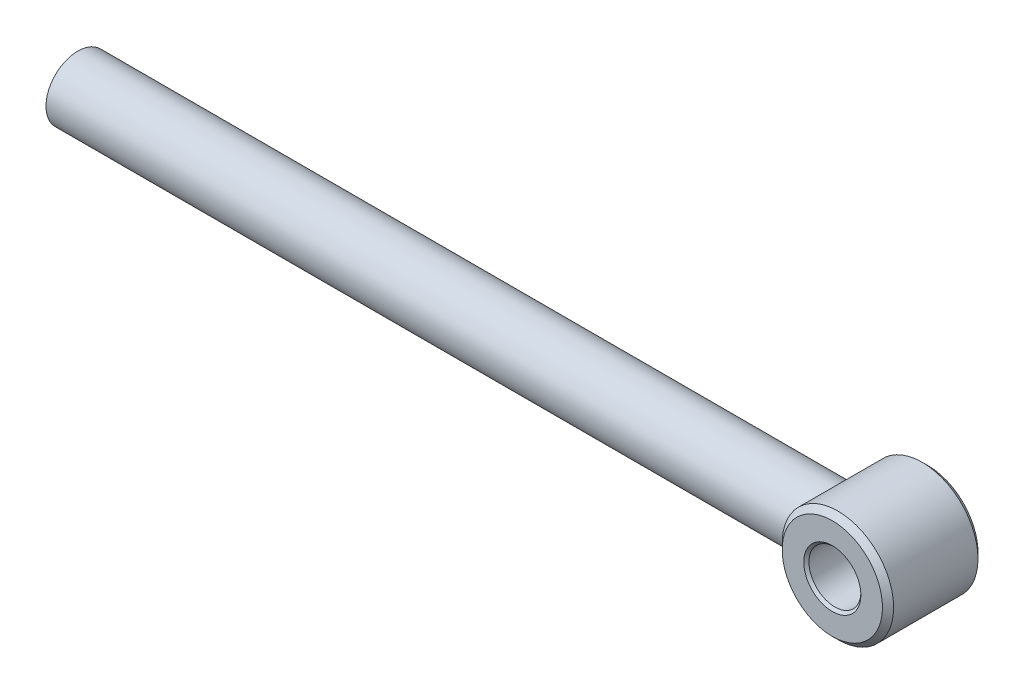
ISO-10303-21;
HEADER;
FILE_DESCRIPTION(('STEP AP214'),'2;1');
FILE_NAME('part.step','',(''),(''),'','','');
FILE_SCHEMA(('AUTOMOTIVE_DESIGN { 1 0 10303 214 1 1 1 1 }'));
ENDSEC;
DATA;
#1=APPLICATION_CONTEXT('core data for automotive mechanical design processes');
#2=APPLICATION_PROTOCOL_DEFINITION('international standard','automotive_design',2000,#1);
#3=PRODUCT_CONTEXT('',#1,'mechanical');
#4=PRODUCT('Part','Part','',(#3));
#5=PRODUCT_RELATED_PRODUCT_CATEGORY('part','',(#4));
#6=PRODUCT_DEFINITION_FORMATION('','',#4);
#7=PRODUCT_DEFINITION_CONTEXT('part definition',#1,'design');
#8=PRODUCT_DEFINITION('design','',#6,#7);
#9=PRODUCT_DEFINITION_SHAPE('','',#8);
#10=(LENGTH_UNIT() NAMED_UNIT(*) SI_UNIT(.MILLI.,.METRE.));
#11=(NAMED_UNIT(*) PLANE_ANGLE_UNIT() SI_UNIT($,.RADIAN.));
#12=(NAMED_UNIT(*) SI_UNIT($,.STERADIAN.) SOLID_ANGLE_UNIT());
#13=UNCERTAINTY_MEASURE_WITH_UNIT(LENGTH_MEASURE(1.E-05),#10,'distance_accuracy_value','');
#14=(GEOMETRIC_REPRESENTATION_CONTEXT(3) GLOBAL_UNCERTAINTY_ASSIGNED_CONTEXT((#13)) GLOBAL_UNIT_ASSIGNED_CONTEXT((#10,
#11,#12)) REPRESENTATION_CONTEXT('',''));
#15=CARTESIAN_POINT('',(0.,0.,0.));
#16=DIRECTION('',(0.,0.,1.));
#17=DIRECTION('',(1.,0.,0.));
#18=AXIS2_PLACEMENT_3D('',#15,#16,#17);
#19=CARTESIAN_POINT('',(340.,0.,-14.5925));
#20=DIRECTION('',(0.,0.,-1.));
#21=DIRECTION('',(1.,0.,0.));
#22=AXIS2_PLACEMENT_3D('',#19,#20,#21);
#23=CONICAL_SURFACE('',#22,8.5575,0.785398163397448);
#24=CARTESIAN_POINT('',(340.,0.,-14.185));
#25=DIRECTION('',(0.,0.,-1.));
#26=DIRECTION('',(1.,0.,0.));
#27=AXIS2_PLACEMENT_3D('',#24,#25,#26);
#28=CIRCLE('',#27,8.15);
#29=CARTESIAN_POINT('',(348.15,0.,-14.185));
#30=VERTEX_POINT('',#29);
#31=EDGE_CURVE('E11',#30,#30,#28,.T.);
#32=ORIENTED_EDGE('',*,*,#31,.F.);
#33=EDGE_LOOP('',(#32));
#34=FACE_BOUND('',#33,.T.);
#35=CARTESIAN_POINT('',(340.,0.,-15.));
#36=DIRECTION('',(0.,0.,1.));
#37=DIRECTION('',(1.,0.,0.));
#38=AXIS2_PLACEMENT_3D('',#35,#36,#37);
#39=CIRCLE('',#38,8.965);
#40=CARTESIAN_POINT('',(348.965,0.,-15.));
#41=VERTEX_POINT('',#40);
#42=EDGE_CURVE('E68',#41,#41,#39,.T.);
#43=ORIENTED_EDGE('',*,*,#42,.F.);
#44=EDGE_LOOP('',(#43));
#45=FACE_BOUND('',#44,.T.);
#46=ADVANCED_FACE('F16',(#34,#45),#23,.F.);
#47=CARTESIAN_POINT('',(340.,0.,14.5925));
#48=DIRECTION('',(0.,0.,1.));
#49=DIRECTION('',(-1.,0.,0.));
#50=AXIS2_PLACEMENT_3D('',#47,#48,#49);
#51=CONICAL_SURFACE('',#50,8.5575,0.785398163397448);
#52=CARTESIAN_POINT('',(340.,0.,14.185));
#53=DIRECTION('',(0.,0.,1.));
#54=DIRECTION('',(1.,0.,0.));
#55=AXIS2_PLACEMENT_3D('',#52,#53,#54);
#56=CIRCLE('',#55,8.15);
#57=CARTESIAN_POINT('',(331.85,0.,14.185));
#58=VERTEX_POINT('',#57);
#59=EDGE_CURVE('E28',#58,#58,#56,.T.);
#60=ORIENTED_EDGE('',*,*,#59,.F.);
#61=EDGE_LOOP('',(#60));
#62=FACE_BOUND('',#61,.T.);
#63=CARTESIAN_POINT('',(340.,0.,15.));
#64=DIRECTION('',(0.,0.,-1.));
#65=DIRECTION('',(-1.,0.,0.));
#66=AXIS2_PLACEMENT_3D('',#63,#64,#65);
#67=CIRCLE('',#66,8.965);
#68=CARTESIAN_POINT('',(331.035,0.,15.));
#69=VERTEX_POINT('',#68);
#70=EDGE_CURVE('E72',#69,#69,#67,.T.);
#71=ORIENTED_EDGE('',*,*,#70,.F.);
#72=EDGE_LOOP('',(#71));
#73=FACE_BOUND('',#72,.T.);
#74=ADVANCED_FACE('F58',(#62,#73),#51,.F.);
#75=CARTESIAN_POINT('',(340.,0.,14.125));
#76=DIRECTION('',(0.,0.,-1.));
#77=DIRECTION('',(1.,0.,0.));
#78=AXIS2_PLACEMENT_3D('',#75,#76,#77);
#79=CONICAL_SURFACE('',#78,16.625,0.785398163397448);
#80=CARTESIAN_POINT('',(340.,0.,13.25));
#81=DIRECTION('',(0.,0.,-1.));
#82=DIRECTION('',(1.,0.,0.));
#83=AXIS2_PLACEMENT_3D('',#80,#81,#82);
#84=CIRCLE('',#83,17.5);
#85=CARTESIAN_POINT('',(357.5,0.,13.25));
#86=VERTEX_POINT('',#85);
#87=EDGE_CURVE('E61',#86,#86,#84,.T.);
#88=ORIENTED_EDGE('',*,*,#87,.F.);
#89=EDGE_LOOP('',(#88));
#90=FACE_BOUND('',#89,.T.);
#91=CARTESIAN_POINT('',(340.,0.,15.));
#92=DIRECTION('',(0.,0.,1.));
#93=DIRECTION('',(1.,0.,0.));
#94=AXIS2_PLACEMENT_3D('',#91,#92,#93);
#95=CIRCLE('',#94,15.75);
#96=CARTESIAN_POINT('',(355.75,0.,15.));
#97=VERTEX_POINT('',#96);
#98=EDGE_CURVE('E73',#97,#97,#95,.T.);
#99=ORIENTED_EDGE('',*,*,#98,.F.);
#100=EDGE_LOOP('',(#99));
#101=FACE_BOUND('',#100,.T.);
#102=ADVANCED_FACE('F103',(#90,#101),#79,.T.);
#103=CARTESIAN_POINT('',(340.,0.,-14.125));
#104=DIRECTION('',(0.,0.,1.));
#105=DIRECTION('',(-1.,0.,0.));
#106=AXIS2_PLACEMENT_3D('',#103,#104,#105);
#107=CONICAL_SURFACE('',#106,16.625,0.785398163397448);
#108=CARTESIAN_POINT('',(340.,0.,-13.25));
#109=DIRECTION('',(0.,0.,1.));
#110=DIRECTION('',(1.,0.,0.));
#111=AXIS2_PLACEMENT_3D('',#108,#109,#110);
#112=CIRCLE('',#111,17.5);
#113=CARTESIAN_POINT('',(322.5,0.,-13.25));
#114=VERTEX_POINT('',#113);
#115=EDGE_CURVE('E64',#114,#114,#112,.T.);
#116=ORIENTED_EDGE('',*,*,#115,.F.);
#117=EDGE_LOOP('',(#116));
#118=FACE_BOUND('',#117,.T.);
#119=CARTESIAN_POINT('',(340.,0.,-15.));
#120=DIRECTION('',(0.,0.,-1.));
#121=DIRECTION('',(-1.,0.,0.));
#122=AXIS2_PLACEMENT_3D('',#119,#120,#121);
#123=CIRCLE('',#122,15.75);
#124=CARTESIAN_POINT('',(324.25,0.,-15.));
#125=VERTEX_POINT('',#124);
#126=EDGE_CURVE('E132',#125,#125,#123,.T.);
#127=ORIENTED_EDGE('',*,*,#126,.F.);
#128=EDGE_LOOP('',(#127));
#129=FACE_BOUND('',#128,.T.);
#130=ADVANCED_FACE('F18',(#118,#129),#107,.T.);
#131=CARTESIAN_POINT('',(340.,0.,0.));
#132=DIRECTION('',(0.,0.,1.));
#133=DIRECTION('',(1.,0.,0.));
#134=AXIS2_PLACEMENT_3D('',#131,#132,#133);
#135=CYLINDRICAL_SURFACE('',#134,8.15);
#136=ORIENTED_EDGE('',*,*,#31,.T.);
#137=EDGE_LOOP('',(#136));
#138=FACE_BOUND('',#137,.T.);
#139=ORIENTED_EDGE('',*,*,#59,.T.);
#140=EDGE_LOOP('',(#139));
#141=FACE_BOUND('',#140,.T.);
#142=ADVANCED_FACE('F120',(#138,#141),#135,.F.);
#143=CARTESIAN_POINT('',(340.,0.,0.));
#144=DIRECTION('',(0.,0.,1.));
#145=DIRECTION('',(1.,0.,0.));
#146=AXIS2_PLACEMENT_3D('',#143,#144,#145);
#147=CYLINDRICAL_SURFACE('',#146,17.5);
#148=ORIENTED_EDGE('',*,*,#87,.T.);
#149=EDGE_LOOP('',(#148));
#150=FACE_BOUND('',#149,.T.);
#151=ORIENTED_EDGE('',*,*,#115,.T.);
#152=EDGE_LOOP('',(#151));
#153=FACE_BOUND('',#152,.T.);
#154=CARTESIAN_POINT('',(325.638593383655,-10.,0.));
#155=CARTESIAN_POINT('',(325.638595003505,-10.0000048389819,0.136265646681078));
#156=CARTESIAN_POINT('',(325.636617806431,-9.99721498646028,0.272528124480369));
#157=CARTESIAN_POINT('',(325.628775606231,-9.98603374754276,0.545867204177963));
#158=CARTESIAN_POINT('',(325.62287786083,-9.97759518200745,0.682940943771078));
#159=CARTESIAN_POINT('',(325.607195929917,-9.95500183322722,0.957661984599778));
#160=CARTESIAN_POINT('',(325.597376559309,-9.94079527948206,1.09530299723614));
#161=CARTESIAN_POINT('',(325.573851801944,-9.90656618316825,1.37091774316944));
#162=CARTESIAN_POINT('',(325.560109041938,-9.88648765846716,1.50888136809838));
#163=CARTESIAN_POINT('',(325.532704608908,-9.84623897778176,1.75005110240869));
#164=CARTESIAN_POINT('',(325.519835473789,-9.82727781839024,1.85355302279388));
#165=CARTESIAN_POINT('',(325.483743831708,-9.77394362593649,2.1208660351658));
#166=CARTESIAN_POINT('',(325.458912306894,-9.73710639467907,2.28397914859385));
#167=CARTESIAN_POINT('',(325.409208662563,-9.66257844689595,2.57946140961682));
#168=CARTESIAN_POINT('',(325.385084037924,-9.62613361418807,2.71227551027135));
#169=CARTESIAN_POINT('',(325.333116771164,-9.54680130270126,2.97969983736737));
#170=CARTESIAN_POINT('',(325.305184629223,-9.50375396053626,3.11424530393299));
#171=CARTESIAN_POINT('',(325.245593089416,-9.41086756409221,3.38476306493335));
#172=CARTESIAN_POINT('',(325.213848170097,-9.36086587110792,3.52066075215788));
#173=CARTESIAN_POINT('',(325.163806558994,-9.28109769183518,3.72379809114615));
#174=CARTESIAN_POINT('',(325.146526561558,-9.2533959033808,3.79210822652283));
#175=CARTESIAN_POINT('',(325.114311776606,-9.20147517966045,3.91619220975079));
#176=CARTESIAN_POINT('',(325.09948856806,-9.1774830112926,3.97208999262497));
#177=CARTESIAN_POINT('',(325.052814214081,-9.10155638071172,4.14463368105699));
#178=CARTESIAN_POINT('',(325.020197946658,-9.04796298698512,4.2603483109679));
#179=CARTESIAN_POINT('',(324.951191293747,-8.93298048395823,4.49669114532114));
#180=CARTESIAN_POINT('',(324.914693326356,-8.87131120849206,4.61715132788688));
#181=CARTESIAN_POINT('',(324.837904813272,-8.73944359671344,4.86237309498186));
#182=CARTESIAN_POINT('',(324.797518765392,-8.66895440435463,4.98694826480841));
#183=CARTESIAN_POINT('',(324.712942975984,-8.51870553638567,5.23970384248437));
#184=CARTESIAN_POINT('',(324.668668184658,-8.43864567751281,5.36767794788196));
#185=CARTESIAN_POINT('',(324.612094426096,-8.33445584234533,5.52615275345391));
#186=CARTESIAN_POINT('',(324.600426936745,-8.31286935443899,5.55857167016023));
#187=CARTESIAN_POINT('',(324.561606572397,-8.24070387763311,5.66559135130116));
#188=CARTESIAN_POINT('',(324.534268994533,-8.18933288057801,5.73959352438746));
#189=CARTESIAN_POINT('',(324.465127592614,-8.05770748751474,5.92384630840231));
#190=CARTESIAN_POINT('',(324.423125407733,-7.97620502654403,6.03313429007466));
#191=CARTESIAN_POINT('',(324.351530314896,-7.83444654871902,6.21533607694731));
#192=CARTESIAN_POINT('',(324.322064203668,-7.77530155490906,6.28916746414324));
#193=CARTESIAN_POINT('',(324.277086579273,-7.68368159121378,6.40027205069158));
#194=CARTESIAN_POINT('',(324.261625583028,-7.65194740303951,6.4381788239484));
#195=CARTESIAN_POINT('',(324.204919047461,-7.53455361135652,6.57631202881291));
#196=CARTESIAN_POINT('',(324.163654215054,-7.44718441095166,6.67508873470167));
#197=CARTESIAN_POINT('',(324.080913285532,-7.2686364714601,6.86908402564224));
#198=CARTESIAN_POINT('',(324.039437140387,-7.17745682895444,6.96430175664181));
#199=CARTESIAN_POINT('',(323.951559866492,-6.97970049448923,7.16280581944989));
#200=CARTESIAN_POINT('',(323.905191899056,-6.87262483158512,7.26561087006375));
#201=CARTESIAN_POINT('',(323.815890209829,-6.6597197181828,7.46108993931631));
#202=CARTESIAN_POINT('',(323.772906649682,-6.55413782768055,7.55401100113305));
#203=CARTESIAN_POINT('',(323.690241182804,-6.34511317262057,7.73027466143245));
#204=CARTESIAN_POINT('',(323.650511272744,-6.24189482258516,7.81386098347104));
#205=CARTESIAN_POINT('',(323.574393955193,-6.03835825595591,7.97206470840645));
#206=CARTESIAN_POINT('',(323.537950158688,-5.93824506458348,8.04691845873951));
#207=CARTESIAN_POINT('',(323.476584865723,-5.76476000917668,8.17162058045933));
#208=CARTESIAN_POINT('',(323.451410298074,-5.69212904011298,8.22238033935225));
#209=CARTESIAN_POINT('',(323.375100327314,-5.46699830950559,8.37529560540107));
#210=CARTESIAN_POINT('',(323.324964944601,-5.31207436532635,8.47442044042709));
#211=CARTESIAN_POINT('',(323.238952705421,-5.03270922929844,8.64244996979506));
#212=CARTESIAN_POINT('',(323.202453233323,-4.90947415577528,8.71305340864138));
#213=CARTESIAN_POINT('',(323.132703033228,-4.66404349994022,8.84678100948775));
#214=CARTESIAN_POINT('',(323.09938322924,-4.54196340029789,8.91008075697989));
#215=CARTESIAN_POINT('',(323.035997761778,-4.29931740634093,9.029589768847));
#216=CARTESIAN_POINT('',(323.005857970098,-4.17885660619719,9.08597273413194));
#217=CARTESIAN_POINT('',(322.962693330504,-3.99793178485476,9.16628241745926));
#218=CARTESIAN_POINT('',(322.948833954229,-3.93845348559588,9.19199597023076));
#219=CARTESIAN_POINT('',(322.920044280244,-3.81181057215831,9.24528870655971));
#220=CARTESIAN_POINT('',(322.905182021995,-3.7445712855716,9.27272726697707));
#221=CARTESIAN_POINT('',(322.862018147753,-3.54359122549166,9.35219391308289));
#222=CARTESIAN_POINT('',(322.834713523223,-3.40881417179647,9.40216522689778));
#223=CARTESIAN_POINT('',(322.783415093816,-3.1391525147113,9.49556317502971));
#224=CARTESIAN_POINT('',(322.759371213882,-3.0043120971679,9.53909005132692));
#225=CARTESIAN_POINT('',(322.714592654471,-2.73485372037379,9.61977165513407));
#226=CARTESIAN_POINT('',(322.693807102404,-2.6002737583903,9.65702520383859));
#227=CARTESIAN_POINT('',(322.650858255102,-2.29871302290534,9.73371788743895));
#228=CARTESIAN_POINT('',(322.629440064548,-2.13126517107645,9.77175764866472));
#229=CARTESIAN_POINT('',(322.598816276872,-1.85999153733725,9.82605778818526));
#230=CARTESIAN_POINT('',(322.588108291293,-1.75686388897706,9.8450213321804));
#231=CARTESIAN_POINT('',(322.565289761676,-1.51614715934074,9.88537566958597));
#232=CARTESIAN_POINT('',(322.553860134253,-1.37828451913664,9.90554211167487));
#233=CARTESIAN_POINT('',(322.53428365521,-1.10241228816948,9.94001517367329));
#234=CARTESIAN_POINT('',(322.52611824969,-0.964408131193409,9.95435492051726));
#235=CARTESIAN_POINT('',(322.513067543901,-0.688496234777946,9.97722574188207));
#236=CARTESIAN_POINT('',(322.50816520592,-0.550591810787741,9.98578699147364));
#237=CARTESIAN_POINT('',(322.501639271139,-0.27512393651721,9.99716058719506));
#238=CARTESIAN_POINT('',(322.500000237973,-0.137561969980766,10.0000000000285));
#239=CARTESIAN_POINT('',(322.499999762046,0.137551285148628,9.99999999997154));
#240=CARTESIAN_POINT('',(322.501638064715,0.275102573741043,9.99716102815475));
#241=CARTESIAN_POINT('',(322.50816298096,0.550554837740219,9.98578896111161));
#242=CARTESIAN_POINT('',(322.513065168059,0.688454316637894,9.97722856553478));
#243=CARTESIAN_POINT('',(322.526115665979,0.964362065671901,9.95435939327012));
#244=CARTESIAN_POINT('',(322.534281147417,1.10236699466384,9.94002020665458));
#245=CARTESIAN_POINT('',(322.553858051899,1.37824643882793,9.90554750047848));
#246=CARTESIAN_POINT('',(322.565288159632,1.51611548183832,9.88538061877666));
#247=CARTESIAN_POINT('',(322.588107343666,1.75684707867718,9.84502442282822));
#248=CARTESIAN_POINT('',(322.598815697707,1.85998316780337,9.82605946343003));
#249=CARTESIAN_POINT('',(322.629438071544,2.13125283120886,9.77176011880755));
#250=CARTESIAN_POINT('',(322.650854097081,2.29868849492066,9.73372345828946));
#251=CARTESIAN_POINT('',(322.693800206873,2.60023386884884,9.65703589302232));
#252=CARTESIAN_POINT('',(322.714585278557,2.73481051410894,9.61978388647958));
#253=CARTESIAN_POINT('',(322.759363630902,3.00426790353636,9.53910400173318));
#254=CARTESIAN_POINT('',(322.783407900511,3.13911056376482,9.4955770755439));
#255=CARTESIAN_POINT('',(322.834707987109,3.40878211307531,9.40217697097076));
#256=CARTESIAN_POINT('',(322.862013989148,3.54356671664262,9.35220332141867));
#257=CARTESIAN_POINT('',(322.90518002791,3.74455997544942,9.27273188205051));
#258=CARTESIAN_POINT('',(322.920043254517,3.81180494792485,9.24529107335733));
#259=CARTESIAN_POINT('',(322.948832489142,3.93844803485362,9.19199826391138));
#260=CARTESIAN_POINT('',(322.962690351278,3.99792093824673,9.16628710623674));
#261=CARTESIAN_POINT('',(323.005851472518,4.17883353514991,9.08598323390403));
#262=CARTESIAN_POINT('',(323.035989462705,4.29928755018249,9.02960387375952));
#263=CARTESIAN_POINT('',(323.099372396823,4.54192530944266,8.91010013999389));
#264=CARTESIAN_POINT('',(323.132691548902,4.66400384573362,8.84680187692901));
#265=CARTESIAN_POINT('',(323.202442535196,4.90943629842995,8.71307480160216));
#266=CARTESIAN_POINT('',(323.238943550514,5.03267460055542,8.64247020941719));
#267=CARTESIAN_POINT('',(323.324957766773,5.31205398064206,8.47443346564276));
#268=CARTESIAN_POINT('',(323.375092636198,5.46698878249495,8.37530203488347));
#269=CARTESIAN_POINT('',(323.453559590876,5.698463000461,8.21807815315953));
#270=CARTESIAN_POINT('',(323.480940609475,5.77729448917181,8.16284988743092));
#271=CARTESIAN_POINT('',(323.547894671901,5.96580903589365,8.02668794170346));
#272=CARTESIAN_POINT('',(323.587776179394,6.0746022354748,7.94466614535044));
#273=CARTESIAN_POINT('',(323.654792419739,6.25213271142503,7.80505596645575));
#274=CARTESIAN_POINT('',(323.681648661975,6.3219075704423,7.74864650405518));
#275=CARTESIAN_POINT('',(323.72165651816,6.42388573011641,7.66391123390873));
#276=CARTESIAN_POINT('',(323.734656367474,6.45671915707161,7.63626996215356));
#277=CARTESIAN_POINT('',(323.786145578995,6.58563594278534,7.52631444513187));
#278=CARTESIAN_POINT('',(323.824934248739,6.68027615378033,7.44243760223767));
#279=CARTESIAN_POINT('',(323.908418543459,6.87915394745544,7.25933662453472));
#280=CARTESIAN_POINT('',(323.953184375671,6.98289214522123,7.15960212937888));
#281=CARTESIAN_POINT('',(324.039251247447,7.1774639837412,6.96429454869161));
#282=CARTESIAN_POINT('',(324.080530679383,7.26865318453167,6.86906561543964));
#283=CARTESIAN_POINT('',(324.163147828495,7.44721029691865,6.67506086040399));
#284=CARTESIAN_POINT('',(324.204485557224,7.53457729175751,6.57628419792926));
#285=CARTESIAN_POINT('',(324.261452461622,7.65194902538374,6.43817690260578));
#286=CARTESIAN_POINT('',(324.277004028487,7.68368162693409,6.40027196682791));
#287=CARTESIAN_POINT('',(324.318921944494,7.76861478966954,6.29727635846098));
#288=CARTESIAN_POINT('',(324.345237210582,7.82129151140527,6.23173183535506));
#289=CARTESIAN_POINT('',(324.413375092326,7.95639332909041,6.05920965692834));
#290=CARTESIAN_POINT('',(324.454955292655,8.03755118369328,5.95113807521602));
#291=CARTESIAN_POINT('',(324.527257032481,8.17595803122223,5.75882502023964));
#292=CARTESIAN_POINT('',(324.55811754939,8.23415054234385,5.67531021252084));
#293=CARTESIAN_POINT('',(324.645651929143,8.39706615086918,5.43370904510663));
#294=CARTESIAN_POINT('',(324.701683257758,8.4987318524676,5.27330322288665));
#295=CARTESIAN_POINT('',(324.797520471813,8.66893458580549,4.98698256022989));
#296=CARTESIAN_POINT('',(324.837896269712,8.73942293729326,4.86241010588034));
#297=CARTESIAN_POINT('',(324.914678094308,8.87129123958173,4.61718978826541));
#298=CARTESIAN_POINT('',(324.951178886937,8.93296187640965,4.49672818163792));
#299=CARTESIAN_POINT('',(325.020189666057,9.04794939631345,4.26037738301275));
#300=CARTESIAN_POINT('',(325.052807335359,9.10154626625091,4.14465611688997));
#301=CARTESIAN_POINT('',(325.099485295275,9.17747848888609,3.97210053112729));
#302=CARTESIAN_POINT('',(325.114310173872,9.20147296416478,3.91619750498116));
#303=CARTESIAN_POINT('',(325.146525386331,9.25339356477483,3.79211381492188));
#304=CARTESIAN_POINT('',(325.163804234755,9.28109313425239,3.72380933040576));
#305=CARTESIAN_POINT('',(325.213843272642,9.36085658814063,3.52068511039633));
#306=CARTESIAN_POINT('',(325.245586606494,9.41085598442,3.38479492366879));
#307=CARTESIAN_POINT('',(325.30517622024,9.50374026881395,3.11428699058353));
#308=CARTESIAN_POINT('',(325.33310790887,9.54678756629075,2.97974374871414));
#309=CARTESIAN_POINT('',(325.385075417275,9.62612157045952,2.71231843239402));
#310=CARTESIAN_POINT('',(325.409200613047,9.66256791860318,2.5795010287427));
#311=CARTESIAN_POINT('',(325.458907442818,9.7371008978372,2.28400350616343));
#312=CARTESIAN_POINT('',(325.483741471434,9.77394118975888,2.12087829236207));
#313=CARTESIAN_POINT('',(325.519835077884,9.82727657366209,1.85355923195002));
#314=CARTESIAN_POINT('',(325.532704042248,9.84623667392294,1.75006358118413));
#315=CARTESIAN_POINT('',(325.560108186059,9.88648402153851,1.5089049114756));
#316=CARTESIAN_POINT('',(325.57385063721,9.90656229821796,1.37094606175006));
#317=CARTESIAN_POINT('',(325.597375054596,9.94079147142311,1.09533659434959));
#318=CARTESIAN_POINT('',(325.60719428119,9.95499817928613,0.957696055200897));
#319=CARTESIAN_POINT('',(325.622876579405,9.9775934553671,0.682972199696133));
#320=CARTESIAN_POINT('',(325.628774715003,9.98603360984129,0.5458951468891));
#321=CARTESIAN_POINT('',(325.636616660145,9.99721336115821,0.272543495812389));
#322=CARTESIAN_POINT('',(325.638593101101,10.0000000038264,0.136271763670317));
#323=CARTESIAN_POINT('',(325.638593666187,9.99999999617386,-0.136261104872579));
#324=CARTESIAN_POINT('',(325.636618099444,9.99721378176346,-0.272522241268471));
#325=CARTESIAN_POINT('',(325.628777438611,9.98603557237087,-0.54585822269299));
#326=CARTESIAN_POINT('',(325.622879545874,9.97759630196437,-0.682930185856598));
#327=CARTESIAN_POINT('',(325.607197329815,9.95500255490585,-0.957650323803953));
#328=CARTESIAN_POINT('',(325.597377781068,9.94079625760181,-1.09529221368495));
#329=CARTESIAN_POINT('',(325.573853485008,9.90656784748367,-1.37090727797517));
#330=CARTESIAN_POINT('',(325.560111333618,9.88648969587624,-1.50887030462386));
#331=CARTESIAN_POINT('',(325.53270428713,9.84623916943546,-1.75004908778524));
#332=CARTESIAN_POINT('',(325.519832780443,9.82727633239844,-1.85355841925912));
#333=CARTESIAN_POINT('',(325.50155322718,9.80026056247388,-1.98896518701923));
#334=CARTESIAN_POINT('',(325.497081783227,9.79364616929549,-2.02128243831528));
#335=CARTESIAN_POINT('',(325.473872816964,9.7592773555642,-2.18507727992182));
#336=CARTESIAN_POINT('',(325.453555513875,9.72907255077864,-2.31583204791711));
#337=CARTESIAN_POINT('',(325.409207863432,9.66257891650285,-2.57945854061846));
#338=CARTESIAN_POINT('',(325.385083821337,9.62613374151988,-2.71227473199179));
#339=CARTESIAN_POINT('',(325.333116995124,9.54680117117176,-2.97970064021822));
#340=CARTESIAN_POINT('',(325.305184689039,9.50375392543713,-3.11424551770171));
#341=CARTESIAN_POINT('',(325.245593028626,9.41086759983425,-3.38476284600826));
#342=CARTESIAN_POINT('',(325.213848159103,9.36086587758702,-3.52066071208164));
#343=CARTESIAN_POINT('',(325.163806564868,9.28109768838316,-3.72379811198201));
#344=CARTESIAN_POINT('',(325.146526563054,9.25339590249772,-3.79210823178658));
#345=CARTESIAN_POINT('',(325.114311775103,9.20147517996332,-3.91619220641929));
#346=CARTESIAN_POINT('',(325.099488567014,9.17748301072761,-3.97208999300182));
#347=CARTESIAN_POINT('',(325.052814213609,9.10155637837131,-4.14463368828222));
#348=CARTESIAN_POINT('',(325.020197945155,9.0479629844014,-4.26034831707043));
#349=CARTESIAN_POINT('',(324.951191291231,8.93298048076104,-4.49669115104972));
#350=CARTESIAN_POINT('',(324.914693323927,8.8713112049246,-4.61715133457491));
#351=CARTESIAN_POINT('',(324.837904811062,8.73944359297323,-4.8623731018799));
#352=CARTESIAN_POINT('',(324.797518763313,8.66895440085539,-4.98694827092609));
#353=CARTESIAN_POINT('',(324.712942974521,8.51870553386551,-5.23970384647949));
#354=CARTESIAN_POINT('',(324.668668183696,8.43864567576615,-5.36767795057581));
#355=CARTESIAN_POINT('',(324.612094425768,8.33445584173986,-5.52615275436524));
#356=CARTESIAN_POINT('',(324.600426936578,8.31286935413454,-5.55857167061292));
#357=CARTESIAN_POINT('',(324.561606571095,8.24070387520005,-5.66559135490659));
#358=CARTESIAN_POINT('',(324.534268991927,8.18933287560906,-5.7395935315387));
#359=CARTESIAN_POINT('',(324.465127588833,8.05770748005535,-5.92384631854789));
#360=CARTESIAN_POINT('',(324.423125404096,7.97620501925685,-6.0331342997377));
#361=CARTESIAN_POINT('',(324.351530312563,7.83444654379873,-6.21533608306513));
#362=CARTESIAN_POINT('',(324.32206420252,7.77530155230013,-6.28916746723251));
#363=CARTESIAN_POINT('',(324.277086579236,7.68368159127937,-6.40027205065099));
#364=CARTESIAN_POINT('',(324.261625582942,7.65194740322902,-6.43817882383094));
#365=CARTESIAN_POINT('',(324.204919047411,7.53455361085978,-6.57631202911595));
#366=CARTESIAN_POINT('',(324.16365421544,7.44718440772908,-6.67508873669044));
#367=CARTESIAN_POINT('',(324.080913284868,7.26863647469676,-6.86908402363854));
#368=CARTESIAN_POINT('',(324.039437138238,7.17745684137958,-6.9643017489587));
#369=CARTESIAN_POINT('',(323.951559867726,6.97970047784419,-7.16280583076959));
#370=CARTESIAN_POINT('',(323.905191906132,6.87262477081295,-7.26561090950243));
#371=CARTESIAN_POINT('',(323.815890197188,6.65971976072576,-7.46108991572731));
#372=CARTESIAN_POINT('',(323.772906613188,6.5541380075283,-7.55401089277276));
#373=CARTESIAN_POINT('',(323.690241208257,6.34511297983283,-7.73027478318703));
#374=CARTESIAN_POINT('',(323.650511377812,6.24189415664979,-7.81386139746217));
#375=CARTESIAN_POINT('',(323.574393848033,6.0383588587014,-7.97206433723317));
#376=CARTESIAN_POINT('',(323.537949781991,5.93824727642981,-8.04691709231203));
#377=CARTESIAN_POINT('',(323.476585128108,5.7647584326867,-8.17162155553305));
#378=CARTESIAN_POINT('',(323.451411147723,5.69212397780024,-8.22238346930889));
#379=CARTESIAN_POINT('',(323.416075778011,5.58788783545129,-8.29318409291648));
#380=CARTESIAN_POINT('',(323.405664541008,5.55688764393627,-8.31398792650388));
#381=CARTESIAN_POINT('',(323.354760664371,5.40385495096821,-8.41544662289618));
#382=CARTESIAN_POINT('',(323.315076496427,5.27996423419571,-8.4937339137856));
#383=CARTESIAN_POINT('',(323.238955429878,5.03271107676219,-8.64244864807457));
#384=CARTESIAN_POINT('',(323.202453947736,4.90947463642957,-8.7130530641254));
#385=CARTESIAN_POINT('',(323.132702340294,4.6640430230073,-8.8467813490745));
#386=CARTESIAN_POINT('',(323.099383049722,4.54196327195129,-8.91008084688771));
#387=CARTESIAN_POINT('',(323.035997931696,4.29931751854441,-9.02958968785613));
#388=CARTESIAN_POINT('',(323.005857999874,4.17885662648504,-9.08597272037904));
#389=CARTESIAN_POINT('',(322.962693315017,3.99793177118414,-9.16628242583477));
#390=CARTESIAN_POINT('',(322.948833949887,3.93845347731485,-9.19199597340571));
#391=CARTESIAN_POINT('',(322.920044284635,3.81181057937169,-9.24528870387079));
#392=CARTESIAN_POINT('',(322.905182022284,3.74457130359383,-9.27272726409108));
#393=CARTESIAN_POINT('',(322.862018145634,3.54359118163011,-9.35219392205938));
#394=CARTESIAN_POINT('',(322.834713532162,3.40881396309459,-9.40216526033842));
#395=CARTESIAN_POINT('',(322.783415082624,3.13915270669788,-9.49556314669046));
#396=CARTESIAN_POINT('',(322.75937117223,3.00431284183245,-9.53908993872973));
#397=CARTESIAN_POINT('',(322.714592692563,2.73485297348338,-9.61977177034376));
#398=CARTESIAN_POINT('',(322.693807248212,2.600271012916,-9.65702562418594));
#399=CARTESIAN_POINT('',(322.655545520989,2.33162786544243,-9.72534728418072));
#400=CARTESIAN_POINT('',(322.638017642878,2.19759886266497,-9.75651203258901));
#401=CARTESIAN_POINT('',(322.618049898734,2.02949821130632,-9.79195066917719));
#402=CARTESIAN_POINT('',(322.614183971697,1.99612501942174,-9.79880844686578));
#403=CARTESIAN_POINT('',(322.598817950871,1.85999909662687,-9.82605583056011));
#404=CARTESIAN_POINT('',(322.588108797525,1.75686617348773,-9.84502074046684));
#405=CARTESIAN_POINT('',(322.565289090448,1.51614412420991,-9.88537645518775));
#406=CARTESIAN_POINT('',(322.553859954994,1.37828370474613,-9.90554232193694));
#407=CARTESIAN_POINT('',(322.534283833478,1.10241308891549,-9.94001496574201));
#408=CARTESIAN_POINT('',(322.526118297099,0.964408342570827,-9.95435486555111));
#409=CARTESIAN_POINT('',(322.513067496771,0.688496015073845,-9.97722579734136));
#410=CARTESIAN_POINT('',(322.508165194219,0.55059174545793,-9.98578700544289));
#411=CARTESIAN_POINT('',(322.501639282798,0.275123995281469,-9.99716057355034));
#412=CARTESIAN_POINT('',(322.500000237773,0.137561999341206,-10.0000000000235));
#413=CARTESIAN_POINT('',(322.499999762246,-0.137551316811433,-9.99999999997655));
#414=CARTESIAN_POINT('',(322.501638077227,-0.275102637023279,-9.99716101443703));
#415=CARTESIAN_POINT('',(322.508162968373,-0.550554780481059,-9.98578897463404));
#416=CARTESIAN_POINT('',(322.513065117805,-0.688454106338331,-9.97722862030886));
#417=CARTESIAN_POINT('',(322.526115716473,-0.964362286644941,-9.95435933741221));
#418=CARTESIAN_POINT('',(322.534281337252,-1.10236780389229,-9.94001999790731));
#419=CARTESIAN_POINT('',(322.553857860913,-1.37824563393075,-9.90554770931334));
#420=CARTESIAN_POINT('',(322.56528744461,-1.51611245824434,-9.8853814023391));
#421=CARTESIAN_POINT('',(322.588107882868,-1.75684936335804,-9.84502383115815));
#422=CARTESIAN_POINT('',(322.598817480827,-1.85999071757222,-9.82605750776429));
#423=CARTESIAN_POINT('',(322.614183458915,-1.99612184793447,-9.79880908167171));
#424=CARTESIAN_POINT('',(322.618048842811,-2.02949187871284,-9.79195197041099));
#425=CARTESIAN_POINT('',(322.638014344166,-2.19758028377312,-9.75651608591925));
#426=CARTESIAN_POINT('',(322.655540790939,-2.33160024977152,-9.72535377299157));
#427=CARTESIAN_POINT('',(322.693800427762,-2.6002311249382,-9.6570363124762));
#428=CARTESIAN_POINT('',(322.714585338671,-2.73480977526095,-9.61978399925559));
#429=CARTESIAN_POINT('',(322.759363571414,-3.00426866082825,-9.53910388538575));
#430=CARTESIAN_POINT('',(322.783407885877,-3.13911076626959,-9.49557704377455));
#431=CARTESIAN_POINT('',(322.834708003473,-3.40878191127688,-9.4021770018021));
#432=CARTESIAN_POINT('',(322.862013990577,-3.54356667826641,-9.35220332833092));
#433=CARTESIAN_POINT('',(322.905180027658,-3.74455999628363,-9.27273187799977));
#434=CARTESIAN_POINT('',(322.920043257236,-3.81180495673515,-9.24529106991948));
#435=CARTESIAN_POINT('',(322.94883248669,-3.93844802688253,-9.19199826702472));
#436=CARTESIAN_POINT('',(322.962690341828,-3.99792092487268,-9.16628711472191));
#437=CARTESIAN_POINT('',(323.005851490933,-4.17883355941302,-9.08598321788992));
#438=CARTESIAN_POINT('',(323.035989568012,-4.29928767443958,-9.02960378472179));
#439=CARTESIAN_POINT('',(323.099372285976,-4.54192517556029,-8.91010023481881));
#440=CARTESIAN_POINT('',(323.13269112023,-4.66400333633044,-8.8468022411379));
#441=CARTESIAN_POINT('',(323.202442977652,-4.9094368207314,-8.713074427208));
#442=CARTESIAN_POINT('',(323.238945237251,-5.03267659551786,-8.64246878012611));
#443=CARTESIAN_POINT('',(323.315069817698,-5.27994093070151,-8.49374855860003));
#444=CARTESIAN_POINT('',(323.354756810975,-5.40383934301014,-8.41545680985647));
#445=CARTESIAN_POINT('',(323.405662791256,-5.55688249090138,-8.31399138399522));
#446=CARTESIAN_POINT('',(323.416074551905,-5.58788535052905,-8.29318578010345));
#447=CARTESIAN_POINT('',(323.453559171906,-5.6984575325295,-8.2180815118653));
#448=CARTESIAN_POINT('',(323.480940482095,-5.77729281586016,-8.16285091499031));
#449=CARTESIAN_POINT('',(323.547894856193,-5.96581141975284,-8.02668647666676));
#450=CARTESIAN_POINT('',(323.587776219533,-6.07460274141806,-7.94466583378803));
#451=CARTESIAN_POINT('',(323.654792395539,-6.25213238405793,-7.80505616694427));
#452=CARTESIAN_POINT('',(323.681648657887,-6.32190751040451,-7.74864654062198));
#453=CARTESIAN_POINT('',(323.721656520214,-6.42388575911291,-7.66391121619328));
#454=CARTESIAN_POINT('',(323.734656367909,-6.45671916752831,-7.63626995592307));
#455=CARTESIAN_POINT('',(323.786145576056,-6.58563590710784,-7.52631446763448));
#456=CARTESIAN_POINT('',(323.824934249128,-6.68027614122079,-7.44243761128689));
#457=CARTESIAN_POINT('',(323.908418541514,-6.87915395743658,-7.25933661820955));
#458=CARTESIAN_POINT('',(323.953184366679,-6.98289215063791,-7.15960212311397));
#459=CARTESIAN_POINT('',(324.039251255348,-7.17746397800175,-6.96429455521165));
#460=CARTESIAN_POINT('',(324.080530708664,-7.26865317236761,-6.86906563372501));
#461=CARTESIAN_POINT('',(324.163147798937,-7.44721030909857,-6.67506084210017));
#462=CARTESIAN_POINT('',(324.204485447425,-7.53457733471433,-6.57628413125606));
#463=CARTESIAN_POINT('',(324.261452502703,-7.65194900927465,-6.43817692760987));
#464=CARTESIAN_POINT('',(324.277004137451,-7.68368158434259,-6.40027203302085));
#465=CARTESIAN_POINT('',(324.318921758345,-7.76861486025676,-6.29727624813647));
#466=CARTESIAN_POINT('',(324.345236327139,-7.82129185228276,-6.23173130438131));
#467=CARTESIAN_POINT('',(324.413376504415,-7.95639277097225,-6.05921052315534));
#468=CARTESIAN_POINT('',(324.454962182359,-8.0375484855274,-5.95114226817262));
#469=CARTESIAN_POINT('',(324.527251845029,-8.17596005338553,-5.75882187651082));
#470=CARTESIAN_POINT('',(324.558100175511,-8.23415732756473,-5.67529966529571));
#471=CARTESIAN_POINT('',(324.600420720526,-8.31286861710137,-5.55857278794079));
#472=CARTESIAN_POINT('',(324.612090539846,-8.33445286845121,-5.5261572370446));
#473=CARTESIAN_POINT('',(324.668671710613,-8.43863444642789,-5.36769518429629));
#474=CARTESIAN_POINT('',(324.712937758091,-8.51869105967039,-5.23972705952814));
#475=CARTESIAN_POINT('',(324.797505856951,-8.66893538537947,-4.98698133374319));
#476=CARTESIAN_POINT('',(324.837892477966,-8.73942314739973,-4.86240978305827));
#477=CARTESIAN_POINT('',(324.914681672275,-8.87129104819091,-4.61719008018807));
#478=CARTESIAN_POINT('',(324.951179796679,-8.93296183023785,-4.49672825029609));
#479=CARTESIAN_POINT('',(325.020188815338,-9.04794944489982,-4.26037730779421));
#480=CARTESIAN_POINT('',(325.052807184643,-9.10154627575386,-4.14465610353599));
#481=CARTESIAN_POINT('',(325.099485368184,-9.17747848593462,-3.97210053391337));
#482=CARTESIAN_POINT('',(325.114310194674,-9.20147296406167,-3.91619750162578));
#483=CARTESIAN_POINT('',(325.146525361628,-9.25339356562194,-3.79211381725206));
#484=CARTESIAN_POINT('',(325.163804231091,-9.28109313189727,-3.72380934892817));
#485=CARTESIAN_POINT('',(325.213843280533,-9.36085659486901,-3.52068506874525));
#486=CARTESIAN_POINT('',(325.245586556504,-9.41085602137556,-3.38479470179299));
#487=CARTESIAN_POINT('',(325.305176269933,-9.50374023581536,-3.11428719767238));
#488=CARTESIAN_POINT('',(325.33310811003,-9.54678743682913,-2.97974454262132));
#489=CARTESIAN_POINT('',(325.385075223271,-9.62612169912534,-2.71231765151924));
#490=CARTESIAN_POINT('',(325.409199892504,-9.66256838890189,-2.57949816537094));
#491=CARTESIAN_POINT('',(325.453549988606,-9.72906615034585,-2.31585947468186));
#492=CARTESIAN_POINT('',(325.473868969702,-9.75927335400613,-2.1850957261484));
#493=CARTESIAN_POINT('',(325.497080547807,-9.79364488190093,-2.02128872702051));
#494=CARTESIAN_POINT('',(325.501552624185,-9.8002599333245,-1.98896833655634));
#495=CARTESIAN_POINT('',(325.519832505741,-9.82727509224236,-1.85356464733759));
#496=CARTESIAN_POINT('',(325.532703767264,-9.84623689772265,-1.75006158578803));
#497=CARTESIAN_POINT('',(325.560110416181,-9.88648601582467,-1.50889382668637));
#498=CARTESIAN_POINT('',(325.573852245319,-9.90656377171882,-1.37093552155102));
#499=CARTESIAN_POINT('',(325.597376350906,-9.94079263775969,-1.09532589150936));
#500=CARTESIAN_POINT('',(325.607195916843,-9.95499960933988,-0.957684681869994));
#501=CARTESIAN_POINT('',(325.622878031177,-9.97759387290537,-0.682961163682852));
#502=CARTESIAN_POINT('',(325.628775691038,-9.98603282350892,-0.54588512388415));
#503=CARTESIAN_POINT('',(325.636617802546,-9.99721474559618,-0.272538649873232));
#504=CARTESIAN_POINT('',(325.638594917266,-10.00000478377,-0.136271071188667));
#505=CARTESIAN_POINT('',(325.638593383655,-10.,0.));
#506=B_SPLINE_CURVE_WITH_KNOTS('',3,(#154,#155,#156,#157,#158,#159,#160,#161,#162,#163,#164,
#165,#166,#167,#168,#169,#170,#171,#172,#173,#174,#175,#176,#177,#178,#179,#180,#181,#182,#183,
#184,#185,#186,#187,#188,#189,#190,#191,#192,#193,#194,#195,#196,#197,#198,#199,#200,#201,#202,
#203,#204,#205,#206,#207,#208,#209,#210,#211,#212,#213,#214,#215,#216,#217,#218,#219,#220,#221,
#222,#223,#224,#225,#226,#227,#228,#229,#230,#231,#232,#233,#234,#235,#236,#237,#238,#239,#240,
#241,#242,#243,#244,#245,#246,#247,#248,#249,#250,#251,#252,#253,#254,#255,#256,#257,#258,#259,
#260,#261,#262,#263,#264,#265,#266,#267,#268,#269,#270,#271,#272,#273,#274,#275,#276,#277,#278,
#279,#280,#281,#282,#283,#284,#285,#286,#287,#288,#289,#290,#291,#292,#293,#294,#295,#296,#297,
#298,#299,#300,#301,#302,#303,#304,#305,#306,#307,#308,#309,#310,#311,#312,#313,#314,#315,#316,
#317,#318,#319,#320,#321,#322,#323,#324,#325,#326,#327,#328,#329,#330,#331,#332,#333,#334,#335,
#336,#337,#338,#339,#340,#341,#342,#343,#344,#345,#346,#347,#348,#349,#350,#351,#352,#353,#354,
#355,#356,#357,#358,#359,#360,#361,#362,#363,#364,#365,#366,#367,#368,#369,#370,#371,#372,#373,
#374,#375,#376,#377,#378,#379,#380,#381,#382,#383,#384,#385,#386,#387,#388,#389,#390,#391,#392,
#393,#394,#395,#396,#397,#398,#399,#400,#401,#402,#403,#404,#405,#406,#407,#408,#409,#410,#411,
#412,#413,#414,#415,#416,#417,#418,#419,#420,#421,#422,#423,#424,#425,#426,#427,#428,#429,#430,
#431,#432,#433,#434,#435,#436,#437,#438,#439,#440,#441,#442,#443,#444,#445,#446,#447,#448,#449,
#450,#451,#452,#453,#454,#455,#456,#457,#458,#459,#460,#461,#462,#463,#464,#465,#466,#467,#468,
#469,#470,#471,#472,#473,#474,#475,#476,#477,#478,#479,#480,#481,#482,#483,#484,#485,#486,#487,
#488,#489,#490,#491,#492,#493,#494,#495,#496,#497,#498,#499,#500,#501,#502,#503,#504,#505),
.UNSPECIFIED.,.F.,.F.,(4,2,2,2,2,2,2,2,2,2,2,2,2,2,2,2,2,2,2,2,2,2,2,2,2,2,2,2,2,2,2,2,2,2,2,2,
2,2,2,2,2,2,2,2,2,2,2,2,2,2,2,2,2,2,2,2,2,2,2,2,2,2,2,2,2,2,2,2,2,2,2,2,2,2,2,2,2,2,2,2,2,2,2,2,
2,2,2,2,2,2,2,2,2,2,2,2,2,2,2,2,2,2,2,2,2,2,2,2,2,2,2,2,2,2,2,2,2,2,2,2,2,2,2,2,2,2,2,2,2,2,2,2,
2,2,2,2,2,2,2,2,2,2,2,2,2,2,2,2,2,2,2,2,2,2,2,2,2,2,2,2,2,2,2,2,2,2,2,2,2,2,2,2,2,2,2,4),(0.,
0.408749756639367,0.820956788313257,1.23694838158263,1.6570429773932,1.97500711135192,
2.48185423673663,2.90117611329414,3.33301706396554,3.77757145457474,4.00468821693562,
4.19250582770425,4.5872780401421,5.007652274894,5.45369228923604,5.92545132100651,
6.0474250369738,6.32981717626354,6.75766491807617,7.05487763778402,7.2102681473521,
7.62468949623324,8.03920966412058,8.50559958175453,8.94668619828686,9.36248392236345,
9.75301009711158,10.0293389842851,10.6009011073317,11.0407007824724,11.4650552885561,
11.8740522317934,12.0728324042456,12.2951973468065,12.7339658206024,13.1649628855633,
13.5883606614535,14.1071729414522,14.4233242509214,14.8425493189208,15.2593564148781,
15.6739697646696,16.0866171703778,16.4992325245804,16.9138309057655,17.3306401405155,
17.7498844510957,18.0660614012241,18.5848355025614,19.0082223621815,19.4392259774601,
19.8780184616236,20.1004019521709,20.2991638597721,20.7081371611906,21.1324852180368,
21.5722956420238,22.1438953738542,22.4440802327431,22.8698455775015,23.1507887661302,
23.285321397299,23.6820501800866,24.1340398224655,24.5484240920471,24.9629072129849,
25.1183718452961,25.3826782168282,25.8067655209725,26.1258261001593,26.7194842623625,
27.1655137687723,27.5858943081667,27.980689633284,28.1685251006869,28.3956233562889,
28.8401537895138,29.2719882042694,29.6913209726402,30.1982061854051,30.5161513281098,
30.9362316601556,31.3522216668601,31.76443980805,32.1732133594994,32.5819549378202,
32.9941581417286,33.4101502829658,33.8302498168526,34.148220538883,34.2480865276696,
34.6551016440336,35.0744235207325,35.5062644713207,35.9508188616306,36.1779356237635,
36.3657532377593,36.7605254543751,37.180899690267,37.6269397027086,38.0986987295377,
38.2206724437941,38.5030645967055,38.9309123371212,39.2281250446051,39.3835155541963,
39.7979369030967,40.2124570709415,40.6788470003993,41.1199336224499,41.5357313457381,
41.9262575133907,42.202586391103,42.318860438713,42.7741839560315,43.2139836330241,
43.6383381379965,44.0473350771595,44.2461152464636,44.4684801923205,44.9072486703824,
45.3382457365069,45.7616435104584,46.1776235475167,46.2804903091498,46.5966416213615,
47.0158666914214,47.4326737876079,47.8472871357926,48.2599345380554,48.6725498957261,
49.0871482785288,49.5039575130479,49.9232018215541,50.2393787689219,50.3422357171327,
50.7581873935089,51.181574253781,51.6125778686673,52.0513703513887,52.2737538408198,
52.4725157471019,52.8814890468125,53.3058371031926,53.7456475279568,54.2009989848921,
54.3172827043343,54.6174675702762,55.0432329143113,55.3241760966112,55.4587087257546,
55.8554375068548,56.3074271529452,56.7218114224855,57.136294543442,57.2917591757759,
57.5560655383375,57.9801528414567,58.2992134306394,58.4211776908083,58.8929094093436,
59.3389389175322,59.7593194558595,60.1541147770664,60.3419502414488,60.5690484991724,
61.0135789351462,61.4454133506527,61.8647461177706,62.2717895306055,62.3716653089804,
62.6896170378062,63.1097023064601,63.5256928609687,63.9379071755426,64.34667255114),.UNSPECIFIED.);
#507=CARTESIAN_POINT('',(325.638593383655,-10.,0.));
#508=VERTEX_POINT('',#507);
#509=EDGE_CURVE('E81',#508,#508,#506,.T.);
#510=ORIENTED_EDGE('',*,*,#509,.F.);
#511=EDGE_LOOP('',(#510));
#512=FACE_BOUND('',#511,.T.);
#513=ADVANCED_FACE('F100',(#150,#153,#512),#147,.T.);
#514=CARTESIAN_POINT('',(340.,0.,15.));
#515=DIRECTION('',(0.,0.,1.));
#516=DIRECTION('',(-1.,0.,0.));
#517=AXIS2_PLACEMENT_3D('',#514,#515,#516);
#518=PLANE('',#517);
#519=ORIENTED_EDGE('',*,*,#70,.T.);
#520=EDGE_LOOP('',(#519));
#521=FACE_BOUND('',#520,.T.);
#522=ORIENTED_EDGE('',*,*,#98,.T.);
#523=EDGE_LOOP('',(#522));
#524=FACE_BOUND('',#523,.T.);
#525=ADVANCED_FACE('F98',(#521,#524),#518,.T.);
#526=CARTESIAN_POINT('',(340.,0.,-15.));
#527=DIRECTION('',(0.,0.,-1.));
#528=DIRECTION('',(1.,0.,0.));
#529=AXIS2_PLACEMENT_3D('',#526,#527,#528);
#530=PLANE('',#529);
#531=ORIENTED_EDGE('',*,*,#42,.T.);
#532=EDGE_LOOP('',(#531));
#533=FACE_BOUND('',#532,.T.);
#534=ORIENTED_EDGE('',*,*,#126,.T.);
#535=EDGE_LOOP('',(#534));
#536=FACE_BOUND('',#535,.T.);
#537=ADVANCED_FACE('F96',(#533,#536),#530,.T.);
#538=CARTESIAN_POINT('',(214.025,0.,0.));
#539=DIRECTION('',(-1.,0.,0.));
#540=DIRECTION('',(0.,-1.,0.));
#541=AXIS2_PLACEMENT_3D('',#538,#539,#540);
#542=CYLINDRICAL_SURFACE('',#541,10.);
#543=ORIENTED_EDGE('',*,*,#509,.T.);
#544=EDGE_LOOP('',(#543));
#545=FACE_BOUND('',#544,.T.);
#546=CARTESIAN_POINT('',(88.05,0.,0.));
#547=DIRECTION('',(-1.,0.,0.));
#548=DIRECTION('',(0.,-1.,0.));
#549=AXIS2_PLACEMENT_3D('',#546,#547,#548);
#550=CIRCLE('',#549,10.);
#551=CARTESIAN_POINT('',(88.05,-10.,0.));
#552=VERTEX_POINT('',#551);
#553=EDGE_CURVE('E135',#552,#552,#550,.T.);
#554=ORIENTED_EDGE('',*,*,#553,.F.);
#555=EDGE_LOOP('',(#554));
#556=FACE_BOUND('',#555,.T.);
#557=ADVANCED_FACE('F85',(#545,#556),#542,.T.);
#558=CARTESIAN_POINT('',(88.05,0.,0.));
#559=DIRECTION('',(-1.,0.,0.));
#560=DIRECTION('',(0.,1.,0.));
#561=AXIS2_PLACEMENT_3D('',#558,#559,#560);
#562=PLANE('',#561);
#563=ORIENTED_EDGE('',*,*,#553,.T.);
#564=EDGE_LOOP('',(#563));
#565=FACE_BOUND('',#564,.T.);
#566=ADVANCED_FACE('F95',(#565),#562,.T.);
#567=CLOSED_SHELL('',(#46,#74,#102,#130,#142,#513,#525,#537,#557,#566));
#568=MANIFOLD_SOLID_BREP('B1',#567);
#569=ADVANCED_BREP_SHAPE_REPRESENTATION('',(#18,#568),#14);
#570=SHAPE_DEFINITION_REPRESENTATION(#9,#569);
ENDSEC;
END-ISO-10303-21;
